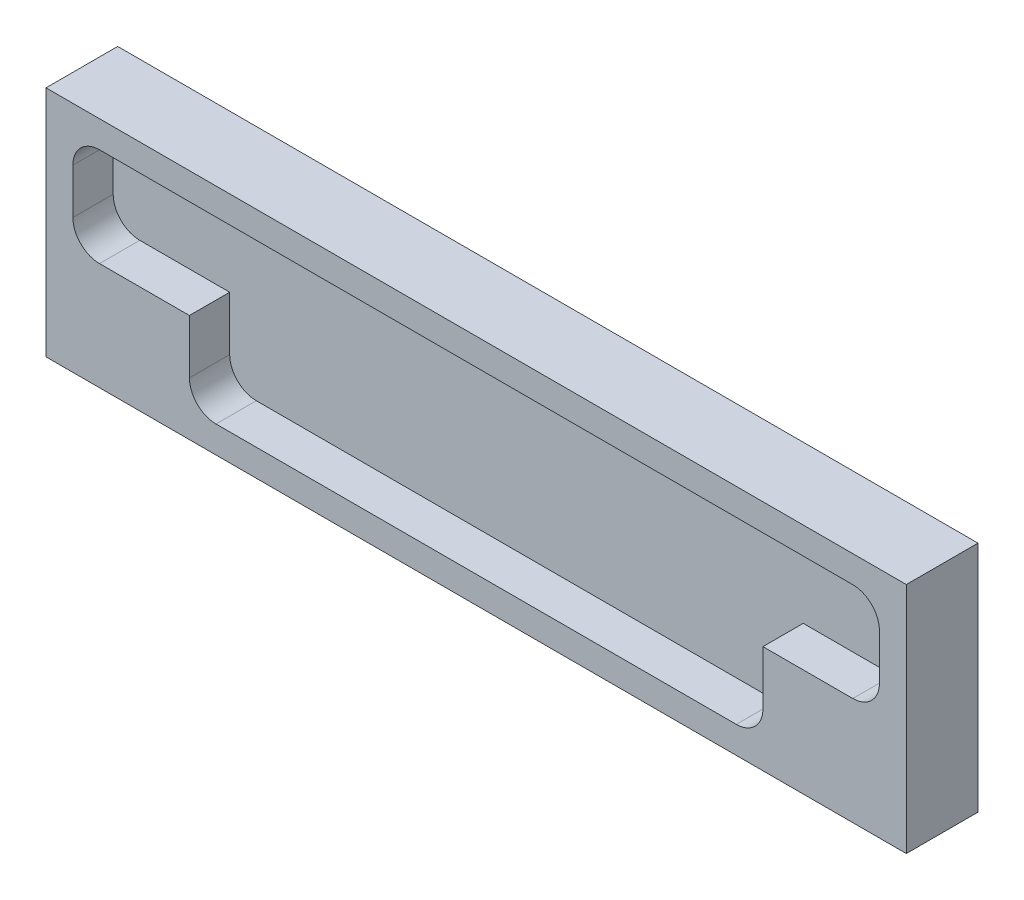
ISO-10303-21;
HEADER;
FILE_DESCRIPTION(('STEP AP214'),'2;1');
FILE_NAME('part.step','',(''),(''),'','','');
FILE_SCHEMA(('AUTOMOTIVE_DESIGN { 1 0 10303 214 1 1 1 1 }'));
ENDSEC;
DATA;
#1=APPLICATION_CONTEXT('core data for automotive mechanical design processes');
#2=APPLICATION_PROTOCOL_DEFINITION('international standard','automotive_design',2000,#1);
#3=PRODUCT_CONTEXT('',#1,'mechanical');
#4=PRODUCT('Part','Part','',(#3));
#5=PRODUCT_RELATED_PRODUCT_CATEGORY('part','',(#4));
#6=PRODUCT_DEFINITION_FORMATION('','',#4);
#7=PRODUCT_DEFINITION_CONTEXT('part definition',#1,'design');
#8=PRODUCT_DEFINITION('design','',#6,#7);
#9=PRODUCT_DEFINITION_SHAPE('','',#8);
#10=(LENGTH_UNIT() NAMED_UNIT(*) SI_UNIT(.MILLI.,.METRE.));
#11=(NAMED_UNIT(*) PLANE_ANGLE_UNIT() SI_UNIT($,.RADIAN.));
#12=(NAMED_UNIT(*) SI_UNIT($,.STERADIAN.) SOLID_ANGLE_UNIT());
#13=UNCERTAINTY_MEASURE_WITH_UNIT(LENGTH_MEASURE(1.E-05),#10,'distance_accuracy_value','');
#14=(GEOMETRIC_REPRESENTATION_CONTEXT(3) GLOBAL_UNCERTAINTY_ASSIGNED_CONTEXT((#13)) GLOBAL_UNIT_ASSIGNED_CONTEXT((#10,
#11,#12)) REPRESENTATION_CONTEXT('',''));
#15=CARTESIAN_POINT('',(0.,0.,0.));
#16=DIRECTION('',(0.,0.,1.));
#17=DIRECTION('',(1.,0.,0.));
#18=AXIS2_PLACEMENT_3D('',#15,#16,#17);
#19=CARTESIAN_POINT('',(76.2,20.6375,12.7));
#20=DIRECTION('',(-1.,0.,0.));
#21=DIRECTION('',(0.,-1.,0.));
#22=AXIS2_PLACEMENT_3D('',#19,#20,#21);
#23=PLANE('',#22);
#24=DIRECTION('',(0.,1.,0.));
#25=VECTOR('',#24,1.);
#26=CARTESIAN_POINT('',(76.2,20.6375,0.));
#27=LINE('',#26,#25);
#28=CARTESIAN_POINT('',(76.2,-20.6375,0.));
#29=VERTEX_POINT('',#28);
#30=CARTESIAN_POINT('',(76.2,20.6375,0.));
#31=VERTEX_POINT('',#30);
#32=EDGE_CURVE('E261',#29,#31,#27,.T.);
#33=ORIENTED_EDGE('',*,*,#32,.T.);
#34=DIRECTION('',(0.,0.,-1.));
#35=VECTOR('',#34,1.);
#36=CARTESIAN_POINT('',(76.2,20.6375,12.7));
#37=LINE('',#36,#35);
#38=CARTESIAN_POINT('',(76.2,20.6375,12.7));
#39=VERTEX_POINT('',#38);
#40=EDGE_CURVE('E11',#39,#31,#37,.T.);
#41=ORIENTED_EDGE('',*,*,#40,.F.);
#42=DIRECTION('',(0.,1.,0.));
#43=VECTOR('',#42,1.);
#44=CARTESIAN_POINT('',(76.2,20.6375,12.7));
#45=LINE('',#44,#43);
#46=CARTESIAN_POINT('',(76.2,-20.6375,12.7));
#47=VERTEX_POINT('',#46);
#48=EDGE_CURVE('E285',#47,#39,#45,.T.);
#49=ORIENTED_EDGE('',*,*,#48,.F.);
#50=DIRECTION('',(0.,0.,-1.));
#51=VECTOR('',#50,1.);
#52=CARTESIAN_POINT('',(76.2,-20.6375,12.7));
#53=LINE('',#52,#51);
#54=EDGE_CURVE('E291',#47,#29,#53,.T.);
#55=ORIENTED_EDGE('',*,*,#54,.T.);
#56=EDGE_LOOP('',(#33,#41,#49,#55));
#57=FACE_BOUND('',#56,.T.);
#58=ADVANCED_FACE('F33',(#57),#23,.F.);
#59=CARTESIAN_POINT('',(-76.2,20.6375,12.7));
#60=DIRECTION('',(0.,-1.,0.));
#61=DIRECTION('',(0.,0.,-1.));
#62=AXIS2_PLACEMENT_3D('',#59,#60,#61);
#63=PLANE('',#62);
#64=DIRECTION('',(-1.,0.,0.));
#65=VECTOR('',#64,1.);
#66=CARTESIAN_POINT('',(-76.2,20.6375,0.));
#67=LINE('',#66,#65);
#68=CARTESIAN_POINT('',(-76.2,20.6375,0.));
#69=VERTEX_POINT('',#68);
#70=EDGE_CURVE('E294',#31,#69,#67,.T.);
#71=ORIENTED_EDGE('',*,*,#70,.T.);
#72=DIRECTION('',(0.,0.,-1.));
#73=VECTOR('',#72,1.);
#74=CARTESIAN_POINT('',(-76.2,20.6375,12.7));
#75=LINE('',#74,#73);
#76=CARTESIAN_POINT('',(-76.2,20.6375,12.7));
#77=VERTEX_POINT('',#76);
#78=EDGE_CURVE('E40',#77,#69,#75,.T.);
#79=ORIENTED_EDGE('',*,*,#78,.F.);
#80=DIRECTION('',(-1.,0.,0.));
#81=VECTOR('',#80,1.);
#82=CARTESIAN_POINT('',(-76.2,20.6375,12.7));
#83=LINE('',#82,#81);
#84=EDGE_CURVE('E84',#39,#77,#83,.T.);
#85=ORIENTED_EDGE('',*,*,#84,.F.);
#86=ORIENTED_EDGE('',*,*,#40,.T.);
#87=EDGE_LOOP('',(#71,#79,#85,#86));
#88=FACE_BOUND('',#87,.T.);
#89=ADVANCED_FACE('F323',(#88),#63,.F.);
#90=CARTESIAN_POINT('',(-76.2,20.6375,12.7));
#91=DIRECTION('',(1.,0.,0.));
#92=DIRECTION('',(0.,0.,-1.));
#93=AXIS2_PLACEMENT_3D('',#90,#91,#92);
#94=PLANE('',#93);
#95=DIRECTION('',(0.,-1.,0.));
#96=VECTOR('',#95,1.);
#97=CARTESIAN_POINT('',(-76.2,20.6375,0.));
#98=LINE('',#97,#96);
#99=CARTESIAN_POINT('',(-76.2,-20.6375,0.));
#100=VERTEX_POINT('',#99);
#101=EDGE_CURVE('E296',#69,#100,#98,.T.);
#102=ORIENTED_EDGE('',*,*,#101,.T.);
#103=DIRECTION('',(0.,0.,-1.));
#104=VECTOR('',#103,1.);
#105=CARTESIAN_POINT('',(-76.2,-20.6375,12.7));
#106=LINE('',#105,#104);
#107=CARTESIAN_POINT('',(-76.2,-20.6375,12.7));
#108=VERTEX_POINT('',#107);
#109=EDGE_CURVE('E300',#108,#100,#106,.T.);
#110=ORIENTED_EDGE('',*,*,#109,.F.);
#111=DIRECTION('',(0.,-1.,0.));
#112=VECTOR('',#111,1.);
#113=CARTESIAN_POINT('',(-76.2,20.6375,12.7));
#114=LINE('',#113,#112);
#115=EDGE_CURVE('E288',#77,#108,#114,.T.);
#116=ORIENTED_EDGE('',*,*,#115,.F.);
#117=ORIENTED_EDGE('',*,*,#78,.T.);
#118=EDGE_LOOP('',(#102,#110,#116,#117));
#119=FACE_BOUND('',#118,.T.);
#120=ADVANCED_FACE('F305',(#119),#94,.F.);
#121=CARTESIAN_POINT('',(-76.2,-20.6375,12.7));
#122=DIRECTION('',(0.,1.,0.));
#123=DIRECTION('',(0.,0.,1.));
#124=AXIS2_PLACEMENT_3D('',#121,#122,#123);
#125=PLANE('',#124);
#126=DIRECTION('',(1.,0.,0.));
#127=VECTOR('',#126,1.);
#128=CARTESIAN_POINT('',(-76.2,-20.6375,0.));
#129=LINE('',#128,#127);
#130=EDGE_CURVE('E77',#100,#29,#129,.T.);
#131=ORIENTED_EDGE('',*,*,#130,.T.);
#132=ORIENTED_EDGE('',*,*,#54,.F.);
#133=DIRECTION('',(1.,0.,0.));
#134=VECTOR('',#133,1.);
#135=CARTESIAN_POINT('',(-76.2,-20.6375,12.7));
#136=LINE('',#135,#134);
#137=EDGE_CURVE('E56',#108,#47,#136,.T.);
#138=ORIENTED_EDGE('',*,*,#137,.F.);
#139=ORIENTED_EDGE('',*,*,#109,.T.);
#140=EDGE_LOOP('',(#131,#132,#138,#139));
#141=FACE_BOUND('',#140,.T.);
#142=ADVANCED_FACE('F313',(#141),#125,.F.);
#143=CARTESIAN_POINT('',(0.,0.,12.7));
#144=DIRECTION('',(0.,0.,1.));
#145=DIRECTION('',(1.,0.,0.));
#146=AXIS2_PLACEMENT_3D('',#143,#144,#145);
#147=PLANE('',#146);
#148=DIRECTION('',(0.,-1.,0.));
#149=VECTOR('',#148,1.);
#150=CARTESIAN_POINT('',(-50.8,-1.58750000000001,12.7));
#151=LINE('',#150,#149);
#152=CARTESIAN_POINT('',(-50.8,-1.58750000000001,12.7));
#153=VERTEX_POINT('',#152);
#154=CARTESIAN_POINT('',(-50.8,-11.1559270650287,12.7));
#155=VERTEX_POINT('',#154);
#156=EDGE_CURVE('E47',#153,#155,#151,.T.);
#157=ORIENTED_EDGE('',*,*,#156,.F.);
#158=DIRECTION('',(1.,0.,0.));
#159=VECTOR('',#158,1.);
#160=CARTESIAN_POINT('',(-50.8,-1.58750000000001,12.7));
#161=LINE('',#160,#159);
#162=CARTESIAN_POINT('',(-66.7184270650287,-1.58750000000001,12.7));
#163=VERTEX_POINT('',#162);
#164=EDGE_CURVE('E187',#163,#153,#161,.T.);
#165=ORIENTED_EDGE('',*,*,#164,.F.);
#166=CARTESIAN_POINT('',(-66.7184270650287,3.1315729349713,12.7));
#167=DIRECTION('',(0.,0.,1.));
#168=DIRECTION('',(-1.,0.,0.));
#169=AXIS2_PLACEMENT_3D('',#166,#167,#168);
#170=CIRCLE('',#169,4.71907293497131);
#171=CARTESIAN_POINT('',(-71.4375,3.1315729349713,12.7));
#172=VERTEX_POINT('',#171);
#173=EDGE_CURVE('E190',#172,#163,#170,.T.);
#174=ORIENTED_EDGE('',*,*,#173,.F.);
#175=DIRECTION('',(0.,-1.,0.));
#176=VECTOR('',#175,1.);
#177=CARTESIAN_POINT('',(-71.4375,11.1559270650287,12.7));
#178=LINE('',#177,#176);
#179=CARTESIAN_POINT('',(-71.4375,11.1559270650287,12.7));
#180=VERTEX_POINT('',#179);
#181=EDGE_CURVE('E254',#180,#172,#178,.T.);
#182=ORIENTED_EDGE('',*,*,#181,.F.);
#183=CARTESIAN_POINT('',(-66.7184270650287,11.1559270650287,12.7));
#184=DIRECTION('',(0.,0.,1.));
#185=DIRECTION('',(1.,0.,0.));
#186=AXIS2_PLACEMENT_3D('',#183,#184,#185);
#187=CIRCLE('',#186,4.71907293497131);
#188=CARTESIAN_POINT('',(-66.7184270650287,15.875,12.7));
#189=VERTEX_POINT('',#188);
#190=EDGE_CURVE('E251',#189,#180,#187,.T.);
#191=ORIENTED_EDGE('',*,*,#190,.F.);
#192=DIRECTION('',(-1.,0.,0.));
#193=VECTOR('',#192,1.);
#194=CARTESIAN_POINT('',(-66.7184270650287,15.875,12.7));
#195=LINE('',#194,#193);
#196=CARTESIAN_POINT('',(66.7184270650287,15.875,12.7));
#197=VERTEX_POINT('',#196);
#198=EDGE_CURVE('E248',#197,#189,#195,.T.);
#199=ORIENTED_EDGE('',*,*,#198,.F.);
#200=CARTESIAN_POINT('',(66.7184270650287,11.1559270650287,12.7));
#201=DIRECTION('',(0.,0.,1.));
#202=DIRECTION('',(-1.,0.,0.));
#203=AXIS2_PLACEMENT_3D('',#200,#201,#202);
#204=CIRCLE('',#203,4.71907293497131);
#205=CARTESIAN_POINT('',(71.4375,11.1559270650287,12.7));
#206=VERTEX_POINT('',#205);
#207=EDGE_CURVE('E245',#206,#197,#204,.T.);
#208=ORIENTED_EDGE('',*,*,#207,.F.);
#209=DIRECTION('',(0.,1.,0.));
#210=VECTOR('',#209,1.);
#211=CARTESIAN_POINT('',(71.4375,11.1559270650287,12.7));
#212=LINE('',#211,#210);
#213=CARTESIAN_POINT('',(71.4375,3.1315729349713,12.7));
#214=VERTEX_POINT('',#213);
#215=EDGE_CURVE('E242',#214,#206,#212,.T.);
#216=ORIENTED_EDGE('',*,*,#215,.F.);
#217=CARTESIAN_POINT('',(66.7184270650287,3.1315729349713,12.7));
#218=DIRECTION('',(0.,0.,1.));
#219=DIRECTION('',(1.,0.,0.));
#220=AXIS2_PLACEMENT_3D('',#217,#218,#219);
#221=CIRCLE('',#220,4.71907293497131);
#222=CARTESIAN_POINT('',(66.7184270650287,-1.58750000000001,12.7));
#223=VERTEX_POINT('',#222);
#224=EDGE_CURVE('E239',#223,#214,#221,.T.);
#225=ORIENTED_EDGE('',*,*,#224,.F.);
#226=DIRECTION('',(1.,0.,0.));
#227=VECTOR('',#226,1.);
#228=CARTESIAN_POINT('',(50.8,-1.58750000000001,12.7));
#229=LINE('',#228,#227);
#230=CARTESIAN_POINT('',(50.8,-1.58750000000001,12.7));
#231=VERTEX_POINT('',#230);
#232=EDGE_CURVE('E236',#231,#223,#229,.T.);
#233=ORIENTED_EDGE('',*,*,#232,.F.);
#234=DIRECTION('',(0.,1.,0.));
#235=VECTOR('',#234,1.);
#236=CARTESIAN_POINT('',(50.8,-1.58750000000001,12.7));
#237=LINE('',#236,#235);
#238=CARTESIAN_POINT('',(50.8,-11.1559270650287,12.7));
#239=VERTEX_POINT('',#238);
#240=EDGE_CURVE('E233',#239,#231,#237,.T.);
#241=ORIENTED_EDGE('',*,*,#240,.F.);
#242=CARTESIAN_POINT('',(46.0809270650287,-11.1559270650287,12.7));
#243=DIRECTION('',(0.,0.,1.));
#244=DIRECTION('',(-1.,0.,0.));
#245=AXIS2_PLACEMENT_3D('',#242,#243,#244);
#246=CIRCLE('',#245,4.71907293497131);
#247=CARTESIAN_POINT('',(46.0809270650287,-15.875,12.7));
#248=VERTEX_POINT('',#247);
#249=EDGE_CURVE('E230',#248,#239,#246,.T.);
#250=ORIENTED_EDGE('',*,*,#249,.F.);
#251=DIRECTION('',(1.,0.,0.));
#252=VECTOR('',#251,1.);
#253=CARTESIAN_POINT('',(-46.0809270650287,-15.875,12.7));
#254=LINE('',#253,#252);
#255=CARTESIAN_POINT('',(-46.0809270650287,-15.875,12.7));
#256=VERTEX_POINT('',#255);
#257=EDGE_CURVE('E227',#256,#248,#254,.T.);
#258=ORIENTED_EDGE('',*,*,#257,.F.);
#259=CARTESIAN_POINT('',(-46.0809270650287,-11.1559270650287,12.7));
#260=DIRECTION('',(0.,0.,1.));
#261=DIRECTION('',(-1.,0.,0.));
#262=AXIS2_PLACEMENT_3D('',#259,#260,#261);
#263=CIRCLE('',#262,4.71907293497131);
#264=EDGE_CURVE('E225',#155,#256,#263,.T.);
#265=ORIENTED_EDGE('',*,*,#264,.F.);
#266=EDGE_LOOP('',(#157,#165,#174,#182,#191,#199,#208,#216,#225,#233,#241,#250,#258,#265));
#267=FACE_BOUND('',#266,.T.);
#268=ORIENTED_EDGE('',*,*,#48,.T.);
#269=ORIENTED_EDGE('',*,*,#84,.T.);
#270=ORIENTED_EDGE('',*,*,#115,.T.);
#271=ORIENTED_EDGE('',*,*,#137,.T.);
#272=EDGE_LOOP('',(#268,#269,#270,#271));
#273=FACE_BOUND('',#272,.T.);
#274=ADVANCED_FACE('F315',(#267,#273),#147,.T.);
#275=CARTESIAN_POINT('',(0.,0.,0.));
#276=DIRECTION('',(0.,0.,1.));
#277=DIRECTION('',(1.,0.,0.));
#278=AXIS2_PLACEMENT_3D('',#275,#276,#277);
#279=PLANE('',#278);
#280=ORIENTED_EDGE('',*,*,#32,.F.);
#281=ORIENTED_EDGE('',*,*,#130,.F.);
#282=ORIENTED_EDGE('',*,*,#101,.F.);
#283=ORIENTED_EDGE('',*,*,#70,.F.);
#284=EDGE_LOOP('',(#280,#281,#282,#283));
#285=FACE_BOUND('',#284,.T.);
#286=ADVANCED_FACE('F309',(#285),#279,.F.);
#287=CARTESIAN_POINT('',(-50.8,-1.58750000000001,5.5626));
#288=DIRECTION('',(-1.,0.,0.));
#289=DIRECTION('',(0.,0.,1.));
#290=AXIS2_PLACEMENT_3D('',#287,#288,#289);
#291=PLANE('',#290);
#292=ORIENTED_EDGE('',*,*,#156,.T.);
#293=DIRECTION('',(0.,0.,1.));
#294=VECTOR('',#293,1.);
#295=CARTESIAN_POINT('',(-50.8,-11.1559270650287,5.5626));
#296=LINE('',#295,#294);
#297=CARTESIAN_POINT('',(-50.8,-11.1559270650287,5.5626));
#298=VERTEX_POINT('',#297);
#299=EDGE_CURVE('E164',#298,#155,#296,.T.);
#300=ORIENTED_EDGE('',*,*,#299,.F.);
#301=DIRECTION('',(0.,-1.,0.));
#302=VECTOR('',#301,1.);
#303=CARTESIAN_POINT('',(-50.8,-1.58750000000001,5.5626));
#304=LINE('',#303,#302);
#305=CARTESIAN_POINT('',(-50.8,-1.58750000000001,5.5626));
#306=VERTEX_POINT('',#305);
#307=EDGE_CURVE('E168',#306,#298,#304,.T.);
#308=ORIENTED_EDGE('',*,*,#307,.F.);
#309=DIRECTION('',(0.,0.,1.));
#310=VECTOR('',#309,1.);
#311=CARTESIAN_POINT('',(-50.8,-1.58750000000001,5.5626));
#312=LINE('',#311,#310);
#313=EDGE_CURVE('E259',#306,#153,#312,.T.);
#314=ORIENTED_EDGE('',*,*,#313,.T.);
#315=EDGE_LOOP('',(#292,#300,#308,#314));
#316=FACE_BOUND('',#315,.T.);
#317=ADVANCED_FACE('F166',(#316),#291,.F.);
#318=CARTESIAN_POINT('',(-50.8,-1.58750000000001,5.5626));
#319=DIRECTION('',(0.,-1.,0.));
#320=DIRECTION('',(1.,0.,0.));
#321=AXIS2_PLACEMENT_3D('',#318,#319,#320);
#322=PLANE('',#321);
#323=ORIENTED_EDGE('',*,*,#164,.T.);
#324=ORIENTED_EDGE('',*,*,#313,.F.);
#325=DIRECTION('',(1.,0.,0.));
#326=VECTOR('',#325,1.);
#327=CARTESIAN_POINT('',(-50.8,-1.58750000000001,5.5626));
#328=LINE('',#327,#326);
#329=CARTESIAN_POINT('',(-66.7184270650287,-1.58750000000001,5.5626));
#330=VERTEX_POINT('',#329);
#331=EDGE_CURVE('E174',#330,#306,#328,.T.);
#332=ORIENTED_EDGE('',*,*,#331,.F.);
#333=DIRECTION('',(0.,0.,1.));
#334=VECTOR('',#333,1.);
#335=CARTESIAN_POINT('',(-66.7184270650287,-1.58750000000001,5.5626));
#336=LINE('',#335,#334);
#337=EDGE_CURVE('E262',#330,#163,#336,.T.);
#338=ORIENTED_EDGE('',*,*,#337,.T.);
#339=EDGE_LOOP('',(#323,#324,#332,#338));
#340=FACE_BOUND('',#339,.T.);
#341=ADVANCED_FACE('F362',(#340),#322,.F.);
#342=CARTESIAN_POINT('',(-66.7184270650287,3.1315729349713,5.5626));
#343=DIRECTION('',(0.,0.,1.));
#344=DIRECTION('',(1.,0.,0.));
#345=AXIS2_PLACEMENT_3D('',#342,#343,#344);
#346=CYLINDRICAL_SURFACE('',#345,4.71907293497131);
#347=ORIENTED_EDGE('',*,*,#173,.T.);
#348=ORIENTED_EDGE('',*,*,#337,.F.);
#349=CARTESIAN_POINT('',(-66.7184270650287,3.1315729349713,5.5626));
#350=DIRECTION('',(0.,0.,1.));
#351=DIRECTION('',(-1.,0.,0.));
#352=AXIS2_PLACEMENT_3D('',#349,#350,#351);
#353=CIRCLE('',#352,4.71907293497131);
#354=CARTESIAN_POINT('',(-71.4375,3.1315729349713,5.5626));
#355=VERTEX_POINT('',#354);
#356=EDGE_CURVE('E221',#355,#330,#353,.T.);
#357=ORIENTED_EDGE('',*,*,#356,.F.);
#358=DIRECTION('',(0.,0.,1.));
#359=VECTOR('',#358,1.);
#360=CARTESIAN_POINT('',(-71.4375,3.1315729349713,5.5626));
#361=LINE('',#360,#359);
#362=EDGE_CURVE('E264',#355,#172,#361,.T.);
#363=ORIENTED_EDGE('',*,*,#362,.T.);
#364=EDGE_LOOP('',(#347,#348,#357,#363));
#365=FACE_BOUND('',#364,.T.);
#366=ADVANCED_FACE('F371',(#365),#346,.F.);
#367=CARTESIAN_POINT('',(-71.4375,11.1559270650287,5.5626));
#368=DIRECTION('',(-1.,0.,0.));
#369=DIRECTION('',(0.,0.,1.));
#370=AXIS2_PLACEMENT_3D('',#367,#368,#369);
#371=PLANE('',#370);
#372=ORIENTED_EDGE('',*,*,#181,.T.);
#373=ORIENTED_EDGE('',*,*,#362,.F.);
#374=DIRECTION('',(0.,-1.,0.));
#375=VECTOR('',#374,1.);
#376=CARTESIAN_POINT('',(-71.4375,11.1559270650287,5.5626));
#377=LINE('',#376,#375);
#378=CARTESIAN_POINT('',(-71.4375,11.1559270650287,5.5626));
#379=VERTEX_POINT('',#378);
#380=EDGE_CURVE('E218',#379,#355,#377,.T.);
#381=ORIENTED_EDGE('',*,*,#380,.F.);
#382=DIRECTION('',(0.,0.,1.));
#383=VECTOR('',#382,1.);
#384=CARTESIAN_POINT('',(-71.4375,11.1559270650287,5.5626));
#385=LINE('',#384,#383);
#386=EDGE_CURVE('E266',#379,#180,#385,.T.);
#387=ORIENTED_EDGE('',*,*,#386,.T.);
#388=EDGE_LOOP('',(#372,#373,#381,#387));
#389=FACE_BOUND('',#388,.T.);
#390=ADVANCED_FACE('F381',(#389),#371,.F.);
#391=CARTESIAN_POINT('',(-66.7184270650287,11.1559270650287,5.5626));
#392=DIRECTION('',(0.,0.,1.));
#393=DIRECTION('',(1.,0.,0.));
#394=AXIS2_PLACEMENT_3D('',#391,#392,#393);
#395=CYLINDRICAL_SURFACE('',#394,4.71907293497131);
#396=ORIENTED_EDGE('',*,*,#190,.T.);
#397=ORIENTED_EDGE('',*,*,#386,.F.);
#398=CARTESIAN_POINT('',(-66.7184270650287,11.1559270650287,5.5626));
#399=DIRECTION('',(0.,0.,1.));
#400=DIRECTION('',(1.,0.,0.));
#401=AXIS2_PLACEMENT_3D('',#398,#399,#400);
#402=CIRCLE('',#401,4.71907293497131);
#403=CARTESIAN_POINT('',(-66.7184270650287,15.875,5.5626));
#404=VERTEX_POINT('',#403);
#405=EDGE_CURVE('E215',#404,#379,#402,.T.);
#406=ORIENTED_EDGE('',*,*,#405,.F.);
#407=DIRECTION('',(0.,0.,1.));
#408=VECTOR('',#407,1.);
#409=CARTESIAN_POINT('',(-66.7184270650287,15.875,5.5626));
#410=LINE('',#409,#408);
#411=EDGE_CURVE('E268',#404,#189,#410,.T.);
#412=ORIENTED_EDGE('',*,*,#411,.T.);
#413=EDGE_LOOP('',(#396,#397,#406,#412));
#414=FACE_BOUND('',#413,.T.);
#415=ADVANCED_FACE('F391',(#414),#395,.F.);
#416=CARTESIAN_POINT('',(-66.7184270650287,15.875,5.5626));
#417=DIRECTION('',(0.,1.,0.));
#418=DIRECTION('',(0.,0.,1.));
#419=AXIS2_PLACEMENT_3D('',#416,#417,#418);
#420=PLANE('',#419);
#421=ORIENTED_EDGE('',*,*,#198,.T.);
#422=ORIENTED_EDGE('',*,*,#411,.F.);
#423=DIRECTION('',(-1.,0.,0.));
#424=VECTOR('',#423,1.);
#425=CARTESIAN_POINT('',(-66.7184270650287,15.875,5.5626));
#426=LINE('',#425,#424);
#427=CARTESIAN_POINT('',(66.7184270650287,15.875,5.5626));
#428=VERTEX_POINT('',#427);
#429=EDGE_CURVE('E212',#428,#404,#426,.T.);
#430=ORIENTED_EDGE('',*,*,#429,.F.);
#431=DIRECTION('',(0.,0.,1.));
#432=VECTOR('',#431,1.);
#433=CARTESIAN_POINT('',(66.7184270650287,15.875,5.5626));
#434=LINE('',#433,#432);
#435=EDGE_CURVE('E270',#428,#197,#434,.T.);
#436=ORIENTED_EDGE('',*,*,#435,.T.);
#437=EDGE_LOOP('',(#421,#422,#430,#436));
#438=FACE_BOUND('',#437,.T.);
#439=ADVANCED_FACE('F401',(#438),#420,.F.);
#440=CARTESIAN_POINT('',(66.7184270650287,11.1559270650287,5.5626));
#441=DIRECTION('',(0.,0.,1.));
#442=DIRECTION('',(1.,0.,0.));
#443=AXIS2_PLACEMENT_3D('',#440,#441,#442);
#444=CYLINDRICAL_SURFACE('',#443,4.71907293497131);
#445=ORIENTED_EDGE('',*,*,#207,.T.);
#446=ORIENTED_EDGE('',*,*,#435,.F.);
#447=CARTESIAN_POINT('',(66.7184270650287,11.1559270650287,5.5626));
#448=DIRECTION('',(0.,0.,1.));
#449=DIRECTION('',(-1.,0.,0.));
#450=AXIS2_PLACEMENT_3D('',#447,#448,#449);
#451=CIRCLE('',#450,4.71907293497131);
#452=CARTESIAN_POINT('',(71.4375,11.1559270650287,5.5626));
#453=VERTEX_POINT('',#452);
#454=EDGE_CURVE('E209',#453,#428,#451,.T.);
#455=ORIENTED_EDGE('',*,*,#454,.F.);
#456=DIRECTION('',(0.,0.,1.));
#457=VECTOR('',#456,1.);
#458=CARTESIAN_POINT('',(71.4375,11.1559270650287,5.5626));
#459=LINE('',#458,#457);
#460=EDGE_CURVE('E272',#453,#206,#459,.T.);
#461=ORIENTED_EDGE('',*,*,#460,.T.);
#462=EDGE_LOOP('',(#445,#446,#455,#461));
#463=FACE_BOUND('',#462,.T.);
#464=ADVANCED_FACE('F411',(#463),#444,.F.);
#465=CARTESIAN_POINT('',(71.4375,11.1559270650287,5.5626));
#466=DIRECTION('',(1.,0.,0.));
#467=DIRECTION('',(0.,0.,-1.));
#468=AXIS2_PLACEMENT_3D('',#465,#466,#467);
#469=PLANE('',#468);
#470=ORIENTED_EDGE('',*,*,#215,.T.);
#471=ORIENTED_EDGE('',*,*,#460,.F.);
#472=DIRECTION('',(0.,1.,0.));
#473=VECTOR('',#472,1.);
#474=CARTESIAN_POINT('',(71.4375,11.1559270650287,5.5626));
#475=LINE('',#474,#473);
#476=CARTESIAN_POINT('',(71.4375,3.1315729349713,5.5626));
#477=VERTEX_POINT('',#476);
#478=EDGE_CURVE('E206',#477,#453,#475,.T.);
#479=ORIENTED_EDGE('',*,*,#478,.F.);
#480=DIRECTION('',(0.,0.,1.));
#481=VECTOR('',#480,1.);
#482=CARTESIAN_POINT('',(71.4375,3.1315729349713,5.5626));
#483=LINE('',#482,#481);
#484=EDGE_CURVE('E274',#477,#214,#483,.T.);
#485=ORIENTED_EDGE('',*,*,#484,.T.);
#486=EDGE_LOOP('',(#470,#471,#479,#485));
#487=FACE_BOUND('',#486,.T.);
#488=ADVANCED_FACE('F421',(#487),#469,.F.);
#489=CARTESIAN_POINT('',(66.7184270650287,3.1315729349713,5.5626));
#490=DIRECTION('',(0.,0.,1.));
#491=DIRECTION('',(1.,0.,0.));
#492=AXIS2_PLACEMENT_3D('',#489,#490,#491);
#493=CYLINDRICAL_SURFACE('',#492,4.71907293497131);
#494=ORIENTED_EDGE('',*,*,#224,.T.);
#495=ORIENTED_EDGE('',*,*,#484,.F.);
#496=CARTESIAN_POINT('',(66.7184270650287,3.1315729349713,5.5626));
#497=DIRECTION('',(0.,0.,1.));
#498=DIRECTION('',(1.,0.,0.));
#499=AXIS2_PLACEMENT_3D('',#496,#497,#498);
#500=CIRCLE('',#499,4.71907293497131);
#501=CARTESIAN_POINT('',(66.7184270650287,-1.58750000000001,5.5626));
#502=VERTEX_POINT('',#501);
#503=EDGE_CURVE('E203',#502,#477,#500,.T.);
#504=ORIENTED_EDGE('',*,*,#503,.F.);
#505=DIRECTION('',(0.,0.,1.));
#506=VECTOR('',#505,1.);
#507=CARTESIAN_POINT('',(66.7184270650287,-1.58750000000001,5.5626));
#508=LINE('',#507,#506);
#509=EDGE_CURVE('E276',#502,#223,#508,.T.);
#510=ORIENTED_EDGE('',*,*,#509,.T.);
#511=EDGE_LOOP('',(#494,#495,#504,#510));
#512=FACE_BOUND('',#511,.T.);
#513=ADVANCED_FACE('F431',(#512),#493,.F.);
#514=CARTESIAN_POINT('',(50.8,-1.58750000000001,5.5626));
#515=DIRECTION('',(0.,-1.,0.));
#516=DIRECTION('',(1.,0.,0.));
#517=AXIS2_PLACEMENT_3D('',#514,#515,#516);
#518=PLANE('',#517);
#519=ORIENTED_EDGE('',*,*,#232,.T.);
#520=ORIENTED_EDGE('',*,*,#509,.F.);
#521=DIRECTION('',(1.,0.,0.));
#522=VECTOR('',#521,1.);
#523=CARTESIAN_POINT('',(50.8,-1.58750000000001,5.5626));
#524=LINE('',#523,#522);
#525=CARTESIAN_POINT('',(50.8,-1.58750000000001,5.5626));
#526=VERTEX_POINT('',#525);
#527=EDGE_CURVE('E200',#526,#502,#524,.T.);
#528=ORIENTED_EDGE('',*,*,#527,.F.);
#529=DIRECTION('',(0.,0.,1.));
#530=VECTOR('',#529,1.);
#531=CARTESIAN_POINT('',(50.8,-1.58750000000001,5.5626));
#532=LINE('',#531,#530);
#533=EDGE_CURVE('E278',#526,#231,#532,.T.);
#534=ORIENTED_EDGE('',*,*,#533,.T.);
#535=EDGE_LOOP('',(#519,#520,#528,#534));
#536=FACE_BOUND('',#535,.T.);
#537=ADVANCED_FACE('F441',(#536),#518,.F.);
#538=CARTESIAN_POINT('',(50.8,-1.58750000000001,5.5626));
#539=DIRECTION('',(1.,0.,0.));
#540=DIRECTION('',(0.,0.,-1.));
#541=AXIS2_PLACEMENT_3D('',#538,#539,#540);
#542=PLANE('',#541);
#543=ORIENTED_EDGE('',*,*,#240,.T.);
#544=ORIENTED_EDGE('',*,*,#533,.F.);
#545=DIRECTION('',(0.,1.,0.));
#546=VECTOR('',#545,1.);
#547=CARTESIAN_POINT('',(50.8,-1.58750000000001,5.5626));
#548=LINE('',#547,#546);
#549=CARTESIAN_POINT('',(50.8,-11.1559270650287,5.5626));
#550=VERTEX_POINT('',#549);
#551=EDGE_CURVE('E197',#550,#526,#548,.T.);
#552=ORIENTED_EDGE('',*,*,#551,.F.);
#553=DIRECTION('',(0.,0.,1.));
#554=VECTOR('',#553,1.);
#555=CARTESIAN_POINT('',(50.8,-11.1559270650287,5.5626));
#556=LINE('',#555,#554);
#557=EDGE_CURVE('E280',#550,#239,#556,.T.);
#558=ORIENTED_EDGE('',*,*,#557,.T.);
#559=EDGE_LOOP('',(#543,#544,#552,#558));
#560=FACE_BOUND('',#559,.T.);
#561=ADVANCED_FACE('F451',(#560),#542,.F.);
#562=CARTESIAN_POINT('',(46.0809270650287,-11.1559270650287,5.5626));
#563=DIRECTION('',(0.,0.,1.));
#564=DIRECTION('',(1.,0.,0.));
#565=AXIS2_PLACEMENT_3D('',#562,#563,#564);
#566=CYLINDRICAL_SURFACE('',#565,4.71907293497131);
#567=ORIENTED_EDGE('',*,*,#249,.T.);
#568=ORIENTED_EDGE('',*,*,#557,.F.);
#569=CARTESIAN_POINT('',(46.0809270650287,-11.1559270650287,5.5626));
#570=DIRECTION('',(0.,0.,1.));
#571=DIRECTION('',(-1.,0.,0.));
#572=AXIS2_PLACEMENT_3D('',#569,#570,#571);
#573=CIRCLE('',#572,4.71907293497131);
#574=CARTESIAN_POINT('',(46.0809270650287,-15.875,5.5626));
#575=VERTEX_POINT('',#574);
#576=EDGE_CURVE('E194',#575,#550,#573,.T.);
#577=ORIENTED_EDGE('',*,*,#576,.F.);
#578=DIRECTION('',(0.,0.,1.));
#579=VECTOR('',#578,1.);
#580=CARTESIAN_POINT('',(46.0809270650287,-15.875,5.5626));
#581=LINE('',#580,#579);
#582=EDGE_CURVE('E282',#575,#248,#581,.T.);
#583=ORIENTED_EDGE('',*,*,#582,.T.);
#584=EDGE_LOOP('',(#567,#568,#577,#583));
#585=FACE_BOUND('',#584,.T.);
#586=ADVANCED_FACE('F461',(#585),#566,.F.);
#587=CARTESIAN_POINT('',(-46.0809270650287,-15.875,5.5626));
#588=DIRECTION('',(0.,-1.,0.));
#589=DIRECTION('',(0.,0.,-1.));
#590=AXIS2_PLACEMENT_3D('',#587,#588,#589);
#591=PLANE('',#590);
#592=ORIENTED_EDGE('',*,*,#257,.T.);
#593=ORIENTED_EDGE('',*,*,#582,.F.);
#594=DIRECTION('',(1.,0.,0.));
#595=VECTOR('',#594,1.);
#596=CARTESIAN_POINT('',(-46.0809270650287,-15.875,5.5626));
#597=LINE('',#596,#595);
#598=CARTESIAN_POINT('',(-46.0809270650287,-15.875,5.5626));
#599=VERTEX_POINT('',#598);
#600=EDGE_CURVE('E182',#599,#575,#597,.T.);
#601=ORIENTED_EDGE('',*,*,#600,.F.);
#602=DIRECTION('',(0.,0.,1.));
#603=VECTOR('',#602,1.);
#604=CARTESIAN_POINT('',(-46.0809270650287,-15.875,5.5626));
#605=LINE('',#604,#603);
#606=EDGE_CURVE('E173',#599,#256,#605,.T.);
#607=ORIENTED_EDGE('',*,*,#606,.T.);
#608=EDGE_LOOP('',(#592,#593,#601,#607));
#609=FACE_BOUND('',#608,.T.);
#610=ADVANCED_FACE('F471',(#609),#591,.F.);
#611=CARTESIAN_POINT('',(-46.0809270650287,-11.1559270650287,5.5626));
#612=DIRECTION('',(0.,0.,1.));
#613=DIRECTION('',(1.,0.,0.));
#614=AXIS2_PLACEMENT_3D('',#611,#612,#613);
#615=CYLINDRICAL_SURFACE('',#614,4.71907293497131);
#616=ORIENTED_EDGE('',*,*,#264,.T.);
#617=ORIENTED_EDGE('',*,*,#606,.F.);
#618=CARTESIAN_POINT('',(-46.0809270650287,-11.1559270650287,5.5626));
#619=DIRECTION('',(0.,0.,1.));
#620=DIRECTION('',(-1.,0.,0.));
#621=AXIS2_PLACEMENT_3D('',#618,#619,#620);
#622=CIRCLE('',#621,4.71907293497131);
#623=EDGE_CURVE('E177',#298,#599,#622,.T.);
#624=ORIENTED_EDGE('',*,*,#623,.F.);
#625=ORIENTED_EDGE('',*,*,#299,.T.);
#626=EDGE_LOOP('',(#616,#617,#624,#625));
#627=FACE_BOUND('',#626,.T.);
#628=ADVANCED_FACE('F178',(#627),#615,.F.);
#629=CARTESIAN_POINT('',(-46.0809270650287,-11.1559270650287,5.5626));
#630=DIRECTION('',(0.,0.,-1.));
#631=DIRECTION('',(-1.,0.,0.));
#632=AXIS2_PLACEMENT_3D('',#629,#630,#631);
#633=PLANE('',#632);
#634=ORIENTED_EDGE('',*,*,#307,.T.);
#635=ORIENTED_EDGE('',*,*,#623,.T.);
#636=ORIENTED_EDGE('',*,*,#600,.T.);
#637=ORIENTED_EDGE('',*,*,#576,.T.);
#638=ORIENTED_EDGE('',*,*,#551,.T.);
#639=ORIENTED_EDGE('',*,*,#527,.T.);
#640=ORIENTED_EDGE('',*,*,#503,.T.);
#641=ORIENTED_EDGE('',*,*,#478,.T.);
#642=ORIENTED_EDGE('',*,*,#454,.T.);
#643=ORIENTED_EDGE('',*,*,#429,.T.);
#644=ORIENTED_EDGE('',*,*,#405,.T.);
#645=ORIENTED_EDGE('',*,*,#380,.T.);
#646=ORIENTED_EDGE('',*,*,#356,.T.);
#647=ORIENTED_EDGE('',*,*,#331,.T.);
#648=EDGE_LOOP('',(#634,#635,#636,#637,#638,#639,#640,#641,#642,#643,#644,#645,#646,#647));
#649=FACE_BOUND('',#648,.T.);
#650=ADVANCED_FACE('F184',(#649),#633,.F.);
#651=CLOSED_SHELL('',(#58,#89,#120,#142,#274,#286,#317,#341,#366,#390,#415,#439,#464,#488,#513,
#537,#561,#586,#610,#628,#650));
#652=MANIFOLD_SOLID_BREP('B2',#651);
#653=ADVANCED_BREP_SHAPE_REPRESENTATION('',(#18,#652),#14);
#654=SHAPE_DEFINITION_REPRESENTATION(#9,#653);
ENDSEC;
END-ISO-10303-21;
